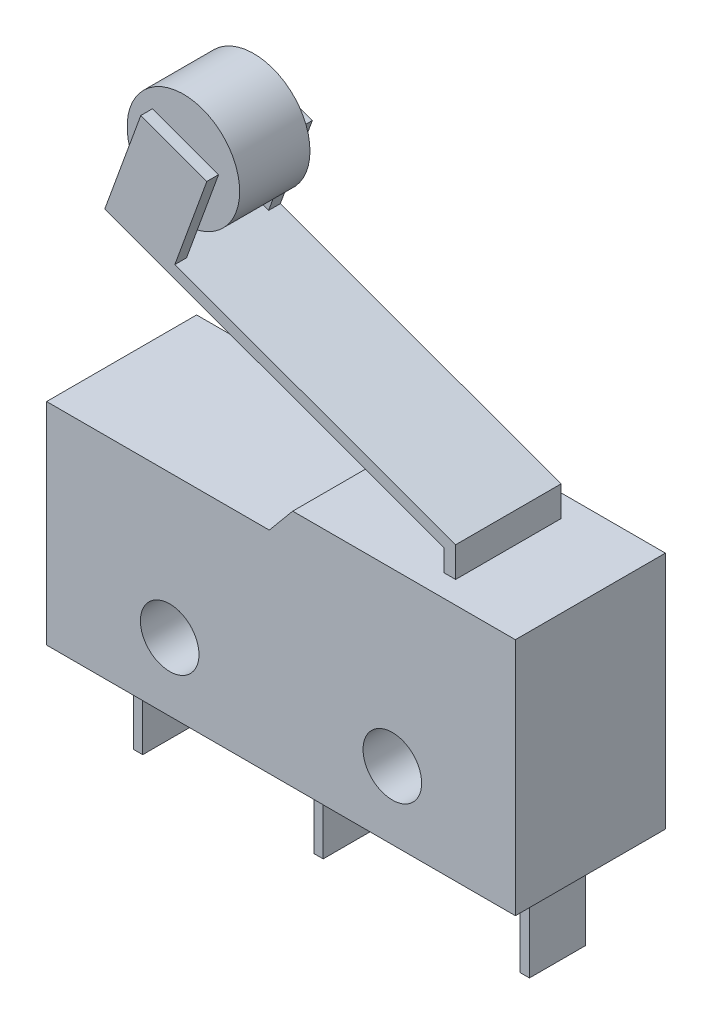
ISO-10303-21;
HEADER;
FILE_DESCRIPTION(('STEP AP214'),'2;1');
FILE_NAME('part.step','',(''),(''),'','','');
FILE_SCHEMA(('AUTOMOTIVE_DESIGN { 1 0 10303 214 1 1 1 1 }'));
ENDSEC;
DATA;
#1=APPLICATION_CONTEXT('core data for automotive mechanical design processes');
#2=APPLICATION_PROTOCOL_DEFINITION('international standard','automotive_design',2000,#1);
#3=PRODUCT_CONTEXT('',#1,'mechanical');
#4=PRODUCT('Part','Part','',(#3));
#5=PRODUCT_RELATED_PRODUCT_CATEGORY('part','',(#4));
#6=PRODUCT_DEFINITION_FORMATION('','',#4);
#7=PRODUCT_DEFINITION_CONTEXT('part definition',#1,'design');
#8=PRODUCT_DEFINITION('design','',#6,#7);
#9=PRODUCT_DEFINITION_SHAPE('','',#8);
#10=(LENGTH_UNIT() NAMED_UNIT(*) SI_UNIT(.MILLI.,.METRE.));
#11=(NAMED_UNIT(*) PLANE_ANGLE_UNIT() SI_UNIT($,.RADIAN.));
#12=(NAMED_UNIT(*) SI_UNIT($,.STERADIAN.) SOLID_ANGLE_UNIT());
#13=UNCERTAINTY_MEASURE_WITH_UNIT(LENGTH_MEASURE(1.E-05),#10,'distance_accuracy_value','');
#14=(GEOMETRIC_REPRESENTATION_CONTEXT(3) GLOBAL_UNCERTAINTY_ASSIGNED_CONTEXT((#13)) GLOBAL_UNIT_ASSIGNED_CONTEXT((#10,
#11,#12)) REPRESENTATION_CONTEXT('',''));
#15=CARTESIAN_POINT('',(0.,0.,0.));
#16=DIRECTION('',(0.,0.,1.));
#17=DIRECTION('',(1.,0.,0.));
#18=AXIS2_PLACEMENT_3D('',#15,#16,#17);
#19=CARTESIAN_POINT('',(4.1360472181271,19.1758939577622,1.5));
#20=DIRECTION('',(0.,0.,-1.));
#21=DIRECTION('',(-1.,0.,0.));
#22=AXIS2_PLACEMENT_3D('',#19,#20,#21);
#23=CYLINDRICAL_SURFACE('',#22,2.4);
#24=CARTESIAN_POINT('',(4.1360472181271,19.1758939577622,1.5));
#25=DIRECTION('',(0.,0.,1.));
#26=DIRECTION('',(1.,0.,0.));
#27=AXIS2_PLACEMENT_3D('',#24,#25,#26);
#28=CIRCLE('',#27,2.4);
#29=CARTESIAN_POINT('',(6.5360472181271,19.1758939577622,1.5));
#30=VERTEX_POINT('',#29);
#31=EDGE_CURVE('E11',#30,#30,#28,.T.);
#32=ORIENTED_EDGE('',*,*,#31,.F.);
#33=EDGE_LOOP('',(#32));
#34=FACE_BOUND('',#33,.T.);
#35=CARTESIAN_POINT('',(4.1360472181271,19.1758939577622,-1.5));
#36=DIRECTION('',(0.,0.,1.));
#37=DIRECTION('',(1.,0.,0.));
#38=AXIS2_PLACEMENT_3D('',#35,#36,#37);
#39=CIRCLE('',#38,2.4);
#40=CARTESIAN_POINT('',(6.5360472181271,19.1758939577622,-1.5));
#41=VERTEX_POINT('',#40);
#42=EDGE_CURVE('E45',#41,#41,#39,.T.);
#43=ORIENTED_EDGE('',*,*,#42,.T.);
#44=EDGE_LOOP('',(#43));
#45=FACE_BOUND('',#44,.T.);
#46=ADVANCED_FACE('F42',(#34,#45),#23,.T.);
#47=CARTESIAN_POINT('',(4.1360472181271,19.1758939577622,1.5));
#48=DIRECTION('',(0.,0.,1.));
#49=DIRECTION('',(1.,0.,0.));
#50=AXIS2_PLACEMENT_3D('',#47,#48,#49);
#51=PLANE('',#50);
#52=ORIENTED_EDGE('',*,*,#31,.T.);
#53=EDGE_LOOP('',(#52));
#54=FACE_BOUND('',#53,.T.);
#55=ADVANCED_FACE('F57',(#54),#51,.T.);
#56=CARTESIAN_POINT('',(4.1360472181271,19.1758939577622,-1.5));
#57=DIRECTION('',(0.,0.,1.));
#58=DIRECTION('',(1.,0.,0.));
#59=AXIS2_PLACEMENT_3D('',#56,#57,#58);
#60=PLANE('',#59);
#61=ORIENTED_EDGE('',*,*,#42,.F.);
#62=EDGE_LOOP('',(#61));
#63=FACE_BOUND('',#62,.T.);
#64=ADVANCED_FACE('F55',(#63),#60,.F.);
#65=CLOSED_SHELL('',(#46,#55,#64));
#66=MANIFOLD_SOLID_BREP('B2',#65);
#67=CARTESIAN_POINT('',(16.5,11.48324984986,2.25));
#68=DIRECTION('',(-0.342020143325663,-0.939692620785911,0.));
#69=DIRECTION('',(0.939692620785911,-0.342020143325663,0.));
#70=AXIS2_PLACEMENT_3D('',#67,#68,#69);
#71=PLANE('',#70);
#72=DIRECTION('',(0.,0.,-1.));
#73=VECTOR('',#72,1.);
#74=CARTESIAN_POINT('',(4.51952571932898,15.843785880416,2.25));
#75=LINE('',#74,#73);
#76=CARTESIAN_POINT('',(4.51952571932898,15.843785880416,2.25));
#77=VERTEX_POINT('',#76);
#78=CARTESIAN_POINT('',(4.51952571932898,15.843785880416,1.75));
#79=VERTEX_POINT('',#78);
#80=EDGE_CURVE('E308',#77,#79,#75,.T.);
#81=ORIENTED_EDGE('',*,*,#80,.F.);
#82=DIRECTION('',(-0.939692620785911,0.342020143325663,0.));
#83=VECTOR('',#82,1.);
#84=CARTESIAN_POINT('',(16.5,11.48324984986,2.25));
#85=LINE('',#84,#83);
#86=CARTESIAN_POINT('',(16.5,11.48324984986,2.25));
#87=VERTEX_POINT('',#86);
#88=EDGE_CURVE('E290',#87,#77,#85,.T.);
#89=ORIENTED_EDGE('',*,*,#88,.F.);
#90=DIRECTION('',(0.,0.,-1.));
#91=VECTOR('',#90,1.);
#92=CARTESIAN_POINT('',(16.5,11.48324984986,2.25));
#93=LINE('',#92,#91);
#94=CARTESIAN_POINT('',(16.5,11.48324984986,-2.25));
#95=VERTEX_POINT('',#94);
#96=EDGE_CURVE('E371',#87,#95,#93,.T.);
#97=ORIENTED_EDGE('',*,*,#96,.T.);
#98=DIRECTION('',(-0.939692620785911,0.342020143325663,0.));
#99=VECTOR('',#98,1.);
#100=CARTESIAN_POINT('',(16.5,11.48324984986,-2.25));
#101=LINE('',#100,#99);
#102=CARTESIAN_POINT('',(4.51952571932897,15.843785880416,-2.25));
#103=VERTEX_POINT('',#102);
#104=EDGE_CURVE('E357',#95,#103,#101,.T.);
#105=ORIENTED_EDGE('',*,*,#104,.T.);
#106=DIRECTION('',(0.,0.,-1.));
#107=VECTOR('',#106,1.);
#108=CARTESIAN_POINT('',(4.51952571932898,15.843785880416,-2.25));
#109=LINE('',#108,#107);
#110=CARTESIAN_POINT('',(4.51952571932898,15.843785880416,-1.75));
#111=VERTEX_POINT('',#110);
#112=EDGE_CURVE('E97',#111,#103,#109,.T.);
#113=ORIENTED_EDGE('',*,*,#112,.F.);
#114=DIRECTION('',(0.93969262078591,-0.342020143325663,0.));
#115=VECTOR('',#114,1.);
#116=CARTESIAN_POINT('',(1.70044785697125,16.869846310393,-1.75));
#117=LINE('',#116,#115);
#118=CARTESIAN_POINT('',(1.70044785697125,16.869846310393,-1.75));
#119=VERTEX_POINT('',#118);
#120=EDGE_CURVE('E320',#119,#111,#117,.T.);
#121=ORIENTED_EDGE('',*,*,#120,.F.);
#122=DIRECTION('',(0.,0.,-1.));
#123=VECTOR('',#122,1.);
#124=CARTESIAN_POINT('',(1.70044785697125,16.869846310393,2.25));
#125=LINE('',#124,#123);
#126=CARTESIAN_POINT('',(1.70044785697125,16.869846310393,1.75));
#127=VERTEX_POINT('',#126);
#128=EDGE_CURVE('E105',#127,#119,#125,.T.);
#129=ORIENTED_EDGE('',*,*,#128,.F.);
#130=DIRECTION('',(-0.93969262078591,0.342020143325663,0.));
#131=VECTOR('',#130,1.);
#132=CARTESIAN_POINT('',(1.70044785697125,16.869846310393,1.75));
#133=LINE('',#132,#131);
#134=EDGE_CURVE('E306',#79,#127,#133,.T.);
#135=ORIENTED_EDGE('',*,*,#134,.F.);
#136=EDGE_LOOP('',(#81,#89,#97,#105,#113,#121,#129,#135));
#137=FACE_BOUND('',#136,.T.);
#138=ADVANCED_FACE('F82',(#137),#71,.F.);
#139=CARTESIAN_POINT('',(10.5,10.2,3.2));
#140=DIRECTION('',(0.,-1.,0.));
#141=DIRECTION('',(0.,0.,-1.));
#142=AXIS2_PLACEMENT_3D('',#139,#140,#141);
#143=PLANE('',#142);
#144=DIRECTION('',(-1.,0.,0.));
#145=VECTOR('',#144,1.);
#146=CARTESIAN_POINT('',(10.5,10.2,-3.2));
#147=LINE('',#146,#145);
#148=CARTESIAN_POINT('',(20.,10.2,-3.2));
#149=VERTEX_POINT('',#148);
#150=CARTESIAN_POINT('',(10.5,10.2,-3.2));
#151=VERTEX_POINT('',#150);
#152=EDGE_CURVE('E509',#149,#151,#147,.T.);
#153=ORIENTED_EDGE('',*,*,#152,.T.);
#154=DIRECTION('',(0.,0.,-1.));
#155=VECTOR('',#154,1.);
#156=CARTESIAN_POINT('',(10.5,10.2,3.2));
#157=LINE('',#156,#155);
#158=CARTESIAN_POINT('',(10.5,10.2,3.2));
#159=VERTEX_POINT('',#158);
#160=EDGE_CURVE('E519',#159,#151,#157,.T.);
#161=ORIENTED_EDGE('',*,*,#160,.F.);
#162=DIRECTION('',(-1.,0.,0.));
#163=VECTOR('',#162,1.);
#164=CARTESIAN_POINT('',(10.5,10.2,3.2));
#165=LINE('',#164,#163);
#166=CARTESIAN_POINT('',(20.,10.2,3.2));
#167=VERTEX_POINT('',#166);
#168=EDGE_CURVE('E496',#167,#159,#165,.T.);
#169=ORIENTED_EDGE('',*,*,#168,.F.);
#170=DIRECTION('',(0.,0.,-1.));
#171=VECTOR('',#170,1.);
#172=CARTESIAN_POINT('',(20.,10.2,3.2));
#173=LINE('',#172,#171);
#174=EDGE_CURVE('E522',#167,#149,#173,.T.);
#175=ORIENTED_EDGE('',*,*,#174,.T.);
#176=EDGE_LOOP('',(#153,#161,#169,#175));
#177=FACE_BOUND('',#176,.T.);
#178=DIRECTION('',(1.,0.,0.));
#179=VECTOR('',#178,1.);
#180=CARTESIAN_POINT('',(16.5,10.2,2.25));
#181=LINE('',#180,#179);
#182=CARTESIAN_POINT('',(16.,10.2,2.25));
#183=VERTEX_POINT('',#182);
#184=CARTESIAN_POINT('',(16.5,10.2,2.25));
#185=VERTEX_POINT('',#184);
#186=EDGE_CURVE('E343',#183,#185,#181,.T.);
#187=ORIENTED_EDGE('',*,*,#186,.F.);
#188=DIRECTION('',(0.,0.,-1.));
#189=VECTOR('',#188,1.);
#190=CARTESIAN_POINT('',(16.,10.2,2.25));
#191=LINE('',#190,#189);
#192=CARTESIAN_POINT('',(16.,10.2,-2.25));
#193=VERTEX_POINT('',#192);
#194=EDGE_CURVE('E352',#183,#193,#191,.T.);
#195=ORIENTED_EDGE('',*,*,#194,.T.);
#196=DIRECTION('',(1.,0.,0.));
#197=VECTOR('',#196,1.);
#198=CARTESIAN_POINT('',(16.5,10.2,-2.25));
#199=LINE('',#198,#197);
#200=CARTESIAN_POINT('',(16.5,10.2,-2.25));
#201=VERTEX_POINT('',#200);
#202=EDGE_CURVE('E342',#193,#201,#199,.T.);
#203=ORIENTED_EDGE('',*,*,#202,.T.);
#204=DIRECTION('',(0.,0.,-1.));
#205=VECTOR('',#204,1.);
#206=CARTESIAN_POINT('',(16.5,10.2,2.25));
#207=LINE('',#206,#205);
#208=EDGE_CURVE('E374',#185,#201,#207,.T.);
#209=ORIENTED_EDGE('',*,*,#208,.F.);
#210=EDGE_LOOP('',(#187,#195,#203,#209));
#211=FACE_BOUND('',#210,.T.);
#212=ADVANCED_FACE('F541',(#177,#211),#143,.F.);
#213=CARTESIAN_POINT('',(0.,0.,3.2));
#214=DIRECTION('',(0.,1.,0.));
#215=DIRECTION('',(0.,0.,1.));
#216=AXIS2_PLACEMENT_3D('',#213,#214,#215);
#217=PLANE('',#216);
#218=DIRECTION('',(0.,0.,-1.));
#219=VECTOR('',#218,1.);
#220=CARTESIAN_POINT('',(9.4,0.,1.2));
#221=LINE('',#220,#219);
#222=CARTESIAN_POINT('',(9.4,0.,1.2));
#223=VERTEX_POINT('',#222);
#224=CARTESIAN_POINT('',(9.4,0.,-1.2));
#225=VERTEX_POINT('',#224);
#226=EDGE_CURVE('E409',#223,#225,#221,.T.);
#227=ORIENTED_EDGE('',*,*,#226,.F.);
#228=DIRECTION('',(-1.,0.,0.));
#229=VECTOR('',#228,1.);
#230=CARTESIAN_POINT('',(9.4,0.,1.2));
#231=LINE('',#230,#229);
#232=CARTESIAN_POINT('',(9.8,0.,1.2));
#233=VERTEX_POINT('',#232);
#234=EDGE_CURVE('E414',#233,#223,#231,.T.);
#235=ORIENTED_EDGE('',*,*,#234,.F.);
#236=DIRECTION('',(0.,0.,1.));
#237=VECTOR('',#236,1.);
#238=CARTESIAN_POINT('',(9.8,0.,1.2));
#239=LINE('',#238,#237);
#240=CARTESIAN_POINT('',(9.8,0.,-1.2));
#241=VERTEX_POINT('',#240);
#242=EDGE_CURVE('E426',#241,#233,#239,.T.);
#243=ORIENTED_EDGE('',*,*,#242,.F.);
#244=DIRECTION('',(1.,0.,0.));
#245=VECTOR('',#244,1.);
#246=CARTESIAN_POINT('',(9.4,0.,-1.2));
#247=LINE('',#246,#245);
#248=EDGE_CURVE('E423',#225,#241,#247,.T.);
#249=ORIENTED_EDGE('',*,*,#248,.F.);
#250=EDGE_LOOP('',(#227,#235,#243,#249));
#251=FACE_BOUND('',#250,.T.);
#252=DIRECTION('',(1.,0.,0.));
#253=VECTOR('',#252,1.);
#254=CARTESIAN_POINT('',(0.,0.,-3.2));
#255=LINE('',#254,#253);
#256=CARTESIAN_POINT('',(0.,0.,-3.2));
#257=VERTEX_POINT('',#256);
#258=CARTESIAN_POINT('',(20.,0.,-3.2));
#259=VERTEX_POINT('',#258);
#260=EDGE_CURVE('E505',#257,#259,#255,.T.);
#261=ORIENTED_EDGE('',*,*,#260,.T.);
#262=DIRECTION('',(0.,0.,-1.));
#263=VECTOR('',#262,1.);
#264=CARTESIAN_POINT('',(20.,0.,3.2));
#265=LINE('',#264,#263);
#266=CARTESIAN_POINT('',(20.,0.,3.2));
#267=VERTEX_POINT('',#266);
#268=EDGE_CURVE('E90',#267,#259,#265,.T.);
#269=ORIENTED_EDGE('',*,*,#268,.F.);
#270=DIRECTION('',(1.,0.,0.));
#271=VECTOR('',#270,1.);
#272=CARTESIAN_POINT('',(0.,0.,3.2));
#273=LINE('',#272,#271);
#274=CARTESIAN_POINT('',(0.,0.,3.2));
#275=VERTEX_POINT('',#274);
#276=EDGE_CURVE('E491',#275,#267,#273,.T.);
#277=ORIENTED_EDGE('',*,*,#276,.F.);
#278=DIRECTION('',(0.,0.,-1.));
#279=VECTOR('',#278,1.);
#280=CARTESIAN_POINT('',(0.,0.,3.2));
#281=LINE('',#280,#279);
#282=EDGE_CURVE('E40',#275,#257,#281,.T.);
#283=ORIENTED_EDGE('',*,*,#282,.T.);
#284=EDGE_LOOP('',(#261,#269,#277,#283));
#285=FACE_BOUND('',#284,.T.);
#286=DIRECTION('',(0.,0.,-1.));
#287=VECTOR('',#286,1.);
#288=CARTESIAN_POINT('',(1.7,0.,1.2));
#289=LINE('',#288,#287);
#290=CARTESIAN_POINT('',(1.7,0.,1.2));
#291=VERTEX_POINT('',#290);
#292=CARTESIAN_POINT('',(1.7,0.,-1.2));
#293=VERTEX_POINT('',#292);
#294=EDGE_CURVE('E442',#291,#293,#289,.T.);
#295=ORIENTED_EDGE('',*,*,#294,.F.);
#296=DIRECTION('',(-1.,0.,0.));
#297=VECTOR('',#296,1.);
#298=CARTESIAN_POINT('',(1.7,0.,1.2));
#299=LINE('',#298,#297);
#300=CARTESIAN_POINT('',(2.1,0.,1.2));
#301=VERTEX_POINT('',#300);
#302=EDGE_CURVE('E447',#301,#291,#299,.T.);
#303=ORIENTED_EDGE('',*,*,#302,.F.);
#304=DIRECTION('',(0.,0.,1.));
#305=VECTOR('',#304,1.);
#306=CARTESIAN_POINT('',(2.1,0.,1.2));
#307=LINE('',#306,#305);
#308=CARTESIAN_POINT('',(2.1,0.,-1.2));
#309=VERTEX_POINT('',#308);
#310=EDGE_CURVE('E459',#309,#301,#307,.T.);
#311=ORIENTED_EDGE('',*,*,#310,.F.);
#312=DIRECTION('',(1.,0.,0.));
#313=VECTOR('',#312,1.);
#314=CARTESIAN_POINT('',(1.7,0.,-1.2));
#315=LINE('',#314,#313);
#316=EDGE_CURVE('E456',#293,#309,#315,.T.);
#317=ORIENTED_EDGE('',*,*,#316,.F.);
#318=EDGE_LOOP('',(#295,#303,#311,#317));
#319=FACE_BOUND('',#318,.T.);
#320=DIRECTION('',(0.,0.,-1.));
#321=VECTOR('',#320,1.);
#322=CARTESIAN_POINT('',(18.2,0.,1.2));
#323=LINE('',#322,#321);
#324=CARTESIAN_POINT('',(18.2,0.,1.2));
#325=VERTEX_POINT('',#324);
#326=CARTESIAN_POINT('',(18.2,0.,-1.2));
#327=VERTEX_POINT('',#326);
#328=EDGE_CURVE('E376',#325,#327,#323,.T.);
#329=ORIENTED_EDGE('',*,*,#328,.F.);
#330=DIRECTION('',(-1.,0.,0.));
#331=VECTOR('',#330,1.);
#332=CARTESIAN_POINT('',(18.2,0.,1.2));
#333=LINE('',#332,#331);
#334=CARTESIAN_POINT('',(18.6,0.,1.2));
#335=VERTEX_POINT('',#334);
#336=EDGE_CURVE('E381',#335,#325,#333,.T.);
#337=ORIENTED_EDGE('',*,*,#336,.F.);
#338=DIRECTION('',(0.,0.,1.));
#339=VECTOR('',#338,1.);
#340=CARTESIAN_POINT('',(18.6,0.,1.2));
#341=LINE('',#340,#339);
#342=CARTESIAN_POINT('',(18.6,0.,-1.2));
#343=VERTEX_POINT('',#342);
#344=EDGE_CURVE('E393',#343,#335,#341,.T.);
#345=ORIENTED_EDGE('',*,*,#344,.F.);
#346=DIRECTION('',(1.,0.,0.));
#347=VECTOR('',#346,1.);
#348=CARTESIAN_POINT('',(18.2,0.,-1.2));
#349=LINE('',#348,#347);
#350=EDGE_CURVE('E390',#327,#343,#349,.T.);
#351=ORIENTED_EDGE('',*,*,#350,.F.);
#352=EDGE_LOOP('',(#329,#337,#345,#351));
#353=FACE_BOUND('',#352,.T.);
#354=ADVANCED_FACE('F555',(#251,#285,#319,#353),#217,.F.);
#355=CARTESIAN_POINT('',(0.,0.,3.2));
#356=DIRECTION('',(0.,0.,-1.));
#357=DIRECTION('',(-1.,0.,0.));
#358=AXIS2_PLACEMENT_3D('',#355,#356,#357);
#359=PLANE('',#358);
#360=CARTESIAN_POINT('',(5.25,2.9,3.2));
#361=DIRECTION('',(0.,0.,1.));
#362=DIRECTION('',(1.,0.,0.));
#363=AXIS2_PLACEMENT_3D('',#360,#361,#362);
#364=CIRCLE('',#363,1.25);
#365=CARTESIAN_POINT('',(6.5,2.9,3.2));
#366=VERTEX_POINT('',#365);
#367=EDGE_CURVE('E482',#366,#366,#364,.T.);
#368=ORIENTED_EDGE('',*,*,#367,.F.);
#369=EDGE_LOOP('',(#368));
#370=FACE_BOUND('',#369,.T.);
#371=DIRECTION('',(0.,-1.,0.));
#372=VECTOR('',#371,1.);
#373=CARTESIAN_POINT('',(0.,0.,3.2));
#374=LINE('',#373,#372);
#375=CARTESIAN_POINT('',(0.,9.,3.2));
#376=VERTEX_POINT('',#375);
#377=EDGE_CURVE('E488',#376,#275,#374,.T.);
#378=ORIENTED_EDGE('',*,*,#377,.T.);
#379=ORIENTED_EDGE('',*,*,#276,.T.);
#380=DIRECTION('',(0.,1.,0.));
#381=VECTOR('',#380,1.);
#382=CARTESIAN_POINT('',(20.,0.,3.2));
#383=LINE('',#382,#381);
#384=EDGE_CURVE('E494',#267,#167,#383,.T.);
#385=ORIENTED_EDGE('',*,*,#384,.T.);
#386=ORIENTED_EDGE('',*,*,#168,.T.);
#387=DIRECTION('',(-0.64018439966448,-0.768221279597375,0.));
#388=VECTOR('',#387,1.);
#389=CARTESIAN_POINT('',(9.5,9.,3.2));
#390=LINE('',#389,#388);
#391=CARTESIAN_POINT('',(9.5,9.,3.2));
#392=VERTEX_POINT('',#391);
#393=EDGE_CURVE('E498',#159,#392,#390,.T.);
#394=ORIENTED_EDGE('',*,*,#393,.T.);
#395=DIRECTION('',(-1.,0.,0.));
#396=VECTOR('',#395,1.);
#397=CARTESIAN_POINT('',(0.,9.,3.2));
#398=LINE('',#397,#396);
#399=EDGE_CURVE('E500',#392,#376,#398,.T.);
#400=ORIENTED_EDGE('',*,*,#399,.T.);
#401=EDGE_LOOP('',(#378,#379,#385,#386,#394,#400));
#402=FACE_BOUND('',#401,.T.);
#403=CARTESIAN_POINT('',(14.75,2.9,3.2));
#404=DIRECTION('',(0.,0.,1.));
#405=DIRECTION('',(1.,0.,0.));
#406=AXIS2_PLACEMENT_3D('',#403,#404,#405);
#407=CIRCLE('',#406,1.25);
#408=CARTESIAN_POINT('',(16.,2.9,3.2));
#409=VERTEX_POINT('',#408);
#410=EDGE_CURVE('E476',#409,#409,#407,.T.);
#411=ORIENTED_EDGE('',*,*,#410,.F.);
#412=EDGE_LOOP('',(#411));
#413=FACE_BOUND('',#412,.T.);
#414=ADVANCED_FACE('F550',(#370,#402,#413),#359,.F.);
#415=CARTESIAN_POINT('',(0.,0.,-3.2));
#416=DIRECTION('',(0.,0.,-1.));
#417=DIRECTION('',(-1.,0.,0.));
#418=AXIS2_PLACEMENT_3D('',#415,#416,#417);
#419=PLANE('',#418);
#420=CARTESIAN_POINT('',(5.25,2.9,-3.2));
#421=DIRECTION('',(0.,0.,1.));
#422=DIRECTION('',(1.,0.,0.));
#423=AXIS2_PLACEMENT_3D('',#420,#421,#422);
#424=CIRCLE('',#423,1.25);
#425=CARTESIAN_POINT('',(6.5,2.9,-3.2));
#426=VERTEX_POINT('',#425);
#427=EDGE_CURVE('E479',#426,#426,#424,.T.);
#428=ORIENTED_EDGE('',*,*,#427,.T.);
#429=EDGE_LOOP('',(#428));
#430=FACE_BOUND('',#429,.T.);
#431=DIRECTION('',(0.,-1.,0.));
#432=VECTOR('',#431,1.);
#433=CARTESIAN_POINT('',(0.,0.,-3.2));
#434=LINE('',#433,#432);
#435=CARTESIAN_POINT('',(0.,9.,-3.2));
#436=VERTEX_POINT('',#435);
#437=EDGE_CURVE('E485',#436,#257,#434,.T.);
#438=ORIENTED_EDGE('',*,*,#437,.F.);
#439=DIRECTION('',(-1.,0.,0.));
#440=VECTOR('',#439,1.);
#441=CARTESIAN_POINT('',(0.,9.,-3.2));
#442=LINE('',#441,#440);
#443=CARTESIAN_POINT('',(9.5,9.,-3.2));
#444=VERTEX_POINT('',#443);
#445=EDGE_CURVE('E492',#444,#436,#442,.T.);
#446=ORIENTED_EDGE('',*,*,#445,.F.);
#447=DIRECTION('',(-0.64018439966448,-0.768221279597375,0.));
#448=VECTOR('',#447,1.);
#449=CARTESIAN_POINT('',(9.5,9.,-3.2));
#450=LINE('',#449,#448);
#451=EDGE_CURVE('E511',#151,#444,#450,.T.);
#452=ORIENTED_EDGE('',*,*,#451,.F.);
#453=ORIENTED_EDGE('',*,*,#152,.F.);
#454=DIRECTION('',(0.,1.,0.));
#455=VECTOR('',#454,1.);
#456=CARTESIAN_POINT('',(20.,0.,-3.2));
#457=LINE('',#456,#455);
#458=EDGE_CURVE('E507',#259,#149,#457,.T.);
#459=ORIENTED_EDGE('',*,*,#458,.F.);
#460=ORIENTED_EDGE('',*,*,#260,.F.);
#461=EDGE_LOOP('',(#438,#446,#452,#453,#459,#460));
#462=FACE_BOUND('',#461,.T.);
#463=CARTESIAN_POINT('',(14.75,2.9,-3.2));
#464=DIRECTION('',(0.,0.,1.));
#465=DIRECTION('',(1.,0.,0.));
#466=AXIS2_PLACEMENT_3D('',#463,#464,#465);
#467=CIRCLE('',#466,1.25);
#468=CARTESIAN_POINT('',(16.,2.9,-3.2));
#469=VERTEX_POINT('',#468);
#470=EDGE_CURVE('E475',#469,#469,#467,.T.);
#471=ORIENTED_EDGE('',*,*,#470,.T.);
#472=EDGE_LOOP('',(#471));
#473=FACE_BOUND('',#472,.T.);
#474=ADVANCED_FACE('F535',(#430,#462,#473),#419,.T.);
#475=CARTESIAN_POINT('',(0.,0.,3.2));
#476=DIRECTION('',(1.,0.,0.));
#477=DIRECTION('',(0.,0.,-1.));
#478=AXIS2_PLACEMENT_3D('',#475,#476,#477);
#479=PLANE('',#478);
#480=ORIENTED_EDGE('',*,*,#437,.T.);
#481=ORIENTED_EDGE('',*,*,#282,.F.);
#482=ORIENTED_EDGE('',*,*,#377,.F.);
#483=DIRECTION('',(0.,0.,-1.));
#484=VECTOR('',#483,1.);
#485=CARTESIAN_POINT('',(0.,9.,3.2));
#486=LINE('',#485,#484);
#487=EDGE_CURVE('E502',#376,#436,#486,.T.);
#488=ORIENTED_EDGE('',*,*,#487,.T.);
#489=EDGE_LOOP('',(#480,#481,#482,#488));
#490=FACE_BOUND('',#489,.T.);
#491=ADVANCED_FACE('F84',(#490),#479,.F.);
#492=CARTESIAN_POINT('',(20.,0.,3.2));
#493=DIRECTION('',(-1.,0.,0.));
#494=DIRECTION('',(0.,0.,1.));
#495=AXIS2_PLACEMENT_3D('',#492,#493,#494);
#496=PLANE('',#495);
#497=ORIENTED_EDGE('',*,*,#458,.T.);
#498=ORIENTED_EDGE('',*,*,#174,.F.);
#499=ORIENTED_EDGE('',*,*,#384,.F.);
#500=ORIENTED_EDGE('',*,*,#268,.T.);
#501=EDGE_LOOP('',(#497,#498,#499,#500));
#502=FACE_BOUND('',#501,.T.);
#503=ADVANCED_FACE('F529',(#502),#496,.F.);
#504=CARTESIAN_POINT('',(9.5,9.,3.2));
#505=DIRECTION('',(0.768221279597376,-0.64018439966448,0.));
#506=DIRECTION('',(0.64018439966448,0.768221279597376,0.));
#507=AXIS2_PLACEMENT_3D('',#504,#505,#506);
#508=PLANE('',#507);
#509=ORIENTED_EDGE('',*,*,#451,.T.);
#510=DIRECTION('',(0.,0.,-1.));
#511=VECTOR('',#510,1.);
#512=CARTESIAN_POINT('',(9.5,9.,3.2));
#513=LINE('',#512,#511);
#514=EDGE_CURVE('E516',#392,#444,#513,.T.);
#515=ORIENTED_EDGE('',*,*,#514,.F.);
#516=ORIENTED_EDGE('',*,*,#393,.F.);
#517=ORIENTED_EDGE('',*,*,#160,.T.);
#518=EDGE_LOOP('',(#509,#515,#516,#517));
#519=FACE_BOUND('',#518,.T.);
#520=ADVANCED_FACE('F546',(#519),#508,.F.);
#521=CARTESIAN_POINT('',(0.,9.,3.2));
#522=DIRECTION('',(0.,-1.,0.));
#523=DIRECTION('',(0.,0.,-1.));
#524=AXIS2_PLACEMENT_3D('',#521,#522,#523);
#525=PLANE('',#524);
#526=ORIENTED_EDGE('',*,*,#445,.T.);
#527=ORIENTED_EDGE('',*,*,#487,.F.);
#528=ORIENTED_EDGE('',*,*,#399,.F.);
#529=ORIENTED_EDGE('',*,*,#514,.T.);
#530=EDGE_LOOP('',(#526,#527,#528,#529));
#531=FACE_BOUND('',#530,.T.);
#532=ADVANCED_FACE('F559',(#531),#525,.F.);
#533=CARTESIAN_POINT('',(5.25,2.9,3.2));
#534=DIRECTION('',(0.,0.,-1.));
#535=DIRECTION('',(-1.,0.,0.));
#536=AXIS2_PLACEMENT_3D('',#533,#534,#535);
#537=CYLINDRICAL_SURFACE('',#536,1.25);
#538=ORIENTED_EDGE('',*,*,#367,.T.);
#539=EDGE_LOOP('',(#538));
#540=FACE_BOUND('',#539,.T.);
#541=ORIENTED_EDGE('',*,*,#427,.F.);
#542=EDGE_LOOP('',(#541));
#543=FACE_BOUND('',#542,.T.);
#544=ADVANCED_FACE('F561',(#540,#543),#537,.F.);
#545=CARTESIAN_POINT('',(14.75,2.9,3.2));
#546=DIRECTION('',(0.,0.,-1.));
#547=DIRECTION('',(-1.,0.,0.));
#548=AXIS2_PLACEMENT_3D('',#545,#546,#547);
#549=CYLINDRICAL_SURFACE('',#548,1.25);
#550=ORIENTED_EDGE('',*,*,#410,.T.);
#551=EDGE_LOOP('',(#550));
#552=FACE_BOUND('',#551,.T.);
#553=ORIENTED_EDGE('',*,*,#470,.F.);
#554=EDGE_LOOP('',(#553));
#555=FACE_BOUND('',#554,.T.);
#556=ADVANCED_FACE('F567',(#552,#555),#549,.F.);
#557=CARTESIAN_POINT('',(1.7,-4.,1.2));
#558=DIRECTION('',(1.,0.,0.));
#559=DIRECTION('',(0.,0.,-1.));
#560=AXIS2_PLACEMENT_3D('',#557,#558,#559);
#561=PLANE('',#560);
#562=ORIENTED_EDGE('',*,*,#294,.T.);
#563=DIRECTION('',(0.,1.,0.));
#564=VECTOR('',#563,1.);
#565=CARTESIAN_POINT('',(1.7,-4.,-1.2));
#566=LINE('',#565,#564);
#567=CARTESIAN_POINT('',(1.7,-4.,-1.2));
#568=VERTEX_POINT('',#567);
#569=EDGE_CURVE('E472',#568,#293,#566,.T.);
#570=ORIENTED_EDGE('',*,*,#569,.F.);
#571=DIRECTION('',(0.,0.,-1.));
#572=VECTOR('',#571,1.);
#573=CARTESIAN_POINT('',(1.7,-4.,1.2));
#574=LINE('',#573,#572);
#575=CARTESIAN_POINT('',(1.7,-4.,1.2));
#576=VERTEX_POINT('',#575);
#577=EDGE_CURVE('E443',#576,#568,#574,.T.);
#578=ORIENTED_EDGE('',*,*,#577,.F.);
#579=DIRECTION('',(0.,1.,0.));
#580=VECTOR('',#579,1.);
#581=CARTESIAN_POINT('',(1.7,-4.,1.2));
#582=LINE('',#581,#580);
#583=EDGE_CURVE('E453',#576,#291,#582,.T.);
#584=ORIENTED_EDGE('',*,*,#583,.T.);
#585=EDGE_LOOP('',(#562,#570,#578,#584));
#586=FACE_BOUND('',#585,.T.);
#587=ADVANCED_FACE('F641',(#586),#561,.F.);
#588=CARTESIAN_POINT('',(1.7,-4.,-1.2));
#589=DIRECTION('',(0.,0.,1.));
#590=DIRECTION('',(1.,0.,0.));
#591=AXIS2_PLACEMENT_3D('',#588,#589,#590);
#592=PLANE('',#591);
#593=ORIENTED_EDGE('',*,*,#316,.T.);
#594=DIRECTION('',(0.,1.,0.));
#595=VECTOR('',#594,1.);
#596=CARTESIAN_POINT('',(2.1,-4.,-1.2));
#597=LINE('',#596,#595);
#598=CARTESIAN_POINT('',(2.1,-4.,-1.2));
#599=VERTEX_POINT('',#598);
#600=EDGE_CURVE('E469',#599,#309,#597,.T.);
#601=ORIENTED_EDGE('',*,*,#600,.F.);
#602=DIRECTION('',(1.,0.,0.));
#603=VECTOR('',#602,1.);
#604=CARTESIAN_POINT('',(1.7,-4.,-1.2));
#605=LINE('',#604,#603);
#606=EDGE_CURVE('E446',#568,#599,#605,.T.);
#607=ORIENTED_EDGE('',*,*,#606,.F.);
#608=ORIENTED_EDGE('',*,*,#569,.T.);
#609=EDGE_LOOP('',(#593,#601,#607,#608));
#610=FACE_BOUND('',#609,.T.);
#611=ADVANCED_FACE('F637',(#610),#592,.F.);
#612=CARTESIAN_POINT('',(2.1,-4.,1.2));
#613=DIRECTION('',(-1.,0.,0.));
#614=DIRECTION('',(0.,0.,1.));
#615=AXIS2_PLACEMENT_3D('',#612,#613,#614);
#616=PLANE('',#615);
#617=ORIENTED_EDGE('',*,*,#310,.T.);
#618=DIRECTION('',(0.,1.,0.));
#619=VECTOR('',#618,1.);
#620=CARTESIAN_POINT('',(2.1,-4.,1.2));
#621=LINE('',#620,#619);
#622=CARTESIAN_POINT('',(2.1,-4.,1.2));
#623=VERTEX_POINT('',#622);
#624=EDGE_CURVE('E466',#623,#301,#621,.T.);
#625=ORIENTED_EDGE('',*,*,#624,.F.);
#626=DIRECTION('',(0.,0.,1.));
#627=VECTOR('',#626,1.);
#628=CARTESIAN_POINT('',(2.1,-4.,1.2));
#629=LINE('',#628,#627);
#630=EDGE_CURVE('E449',#599,#623,#629,.T.);
#631=ORIENTED_EDGE('',*,*,#630,.F.);
#632=ORIENTED_EDGE('',*,*,#600,.T.);
#633=EDGE_LOOP('',(#617,#625,#631,#632));
#634=FACE_BOUND('',#633,.T.);
#635=ADVANCED_FACE('F633',(#634),#616,.F.);
#636=CARTESIAN_POINT('',(1.7,-4.,1.2));
#637=DIRECTION('',(0.,0.,-1.));
#638=DIRECTION('',(-1.,0.,0.));
#639=AXIS2_PLACEMENT_3D('',#636,#637,#638);
#640=PLANE('',#639);
#641=ORIENTED_EDGE('',*,*,#302,.T.);
#642=ORIENTED_EDGE('',*,*,#583,.F.);
#643=DIRECTION('',(-1.,0.,0.));
#644=VECTOR('',#643,1.);
#645=CARTESIAN_POINT('',(1.7,-4.,1.2));
#646=LINE('',#645,#644);
#647=EDGE_CURVE('E451',#623,#576,#646,.T.);
#648=ORIENTED_EDGE('',*,*,#647,.F.);
#649=ORIENTED_EDGE('',*,*,#624,.T.);
#650=EDGE_LOOP('',(#641,#642,#648,#649));
#651=FACE_BOUND('',#650,.T.);
#652=ADVANCED_FACE('F629',(#651),#640,.F.);
#653=CARTESIAN_POINT('',(0.,-4.,0.));
#654=DIRECTION('',(0.,-1.,0.));
#655=DIRECTION('',(0.,0.,-1.));
#656=AXIS2_PLACEMENT_3D('',#653,#654,#655);
#657=PLANE('',#656);
#658=ORIENTED_EDGE('',*,*,#577,.T.);
#659=ORIENTED_EDGE('',*,*,#606,.T.);
#660=ORIENTED_EDGE('',*,*,#630,.T.);
#661=ORIENTED_EDGE('',*,*,#647,.T.);
#662=EDGE_LOOP('',(#658,#659,#660,#661));
#663=FACE_BOUND('',#662,.T.);
#664=ADVANCED_FACE('F625',(#663),#657,.T.);
#665=CARTESIAN_POINT('',(9.4,-4.,1.2));
#666=DIRECTION('',(1.,0.,0.));
#667=DIRECTION('',(0.,0.,-1.));
#668=AXIS2_PLACEMENT_3D('',#665,#666,#667);
#669=PLANE('',#668);
#670=ORIENTED_EDGE('',*,*,#226,.T.);
#671=DIRECTION('',(0.,1.,0.));
#672=VECTOR('',#671,1.);
#673=CARTESIAN_POINT('',(9.4,-4.,-1.2));
#674=LINE('',#673,#672);
#675=CARTESIAN_POINT('',(9.4,-4.,-1.2));
#676=VERTEX_POINT('',#675);
#677=EDGE_CURVE('E439',#676,#225,#674,.T.);
#678=ORIENTED_EDGE('',*,*,#677,.F.);
#679=DIRECTION('',(0.,0.,-1.));
#680=VECTOR('',#679,1.);
#681=CARTESIAN_POINT('',(9.4,-4.,1.2));
#682=LINE('',#681,#680);
#683=CARTESIAN_POINT('',(9.4,-4.,1.2));
#684=VERTEX_POINT('',#683);
#685=EDGE_CURVE('E410',#684,#676,#682,.T.);
#686=ORIENTED_EDGE('',*,*,#685,.F.);
#687=DIRECTION('',(0.,1.,0.));
#688=VECTOR('',#687,1.);
#689=CARTESIAN_POINT('',(9.4,-4.,1.2));
#690=LINE('',#689,#688);
#691=EDGE_CURVE('E420',#684,#223,#690,.T.);
#692=ORIENTED_EDGE('',*,*,#691,.T.);
#693=EDGE_LOOP('',(#670,#678,#686,#692));
#694=FACE_BOUND('',#693,.T.);
#695=ADVANCED_FACE('F621',(#694),#669,.F.);
#696=CARTESIAN_POINT('',(9.4,-4.,-1.2));
#697=DIRECTION('',(0.,0.,1.));
#698=DIRECTION('',(1.,0.,0.));
#699=AXIS2_PLACEMENT_3D('',#696,#697,#698);
#700=PLANE('',#699);
#701=ORIENTED_EDGE('',*,*,#248,.T.);
#702=DIRECTION('',(0.,1.,0.));
#703=VECTOR('',#702,1.);
#704=CARTESIAN_POINT('',(9.8,-4.,-1.2));
#705=LINE('',#704,#703);
#706=CARTESIAN_POINT('',(9.8,-4.,-1.2));
#707=VERTEX_POINT('',#706);
#708=EDGE_CURVE('E436',#707,#241,#705,.T.);
#709=ORIENTED_EDGE('',*,*,#708,.F.);
#710=DIRECTION('',(1.,0.,0.));
#711=VECTOR('',#710,1.);
#712=CARTESIAN_POINT('',(9.4,-4.,-1.2));
#713=LINE('',#712,#711);
#714=EDGE_CURVE('E413',#676,#707,#713,.T.);
#715=ORIENTED_EDGE('',*,*,#714,.F.);
#716=ORIENTED_EDGE('',*,*,#677,.T.);
#717=EDGE_LOOP('',(#701,#709,#715,#716));
#718=FACE_BOUND('',#717,.T.);
#719=ADVANCED_FACE('F617',(#718),#700,.F.);
#720=CARTESIAN_POINT('',(9.8,-4.,1.2));
#721=DIRECTION('',(-1.,0.,0.));
#722=DIRECTION('',(0.,0.,1.));
#723=AXIS2_PLACEMENT_3D('',#720,#721,#722);
#724=PLANE('',#723);
#725=ORIENTED_EDGE('',*,*,#242,.T.);
#726=DIRECTION('',(0.,1.,0.));
#727=VECTOR('',#726,1.);
#728=CARTESIAN_POINT('',(9.8,-4.,1.2));
#729=LINE('',#728,#727);
#730=CARTESIAN_POINT('',(9.8,-4.,1.2));
#731=VERTEX_POINT('',#730);
#732=EDGE_CURVE('E433',#731,#233,#729,.T.);
#733=ORIENTED_EDGE('',*,*,#732,.F.);
#734=DIRECTION('',(0.,0.,1.));
#735=VECTOR('',#734,1.);
#736=CARTESIAN_POINT('',(9.8,-4.,1.2));
#737=LINE('',#736,#735);
#738=EDGE_CURVE('E416',#707,#731,#737,.T.);
#739=ORIENTED_EDGE('',*,*,#738,.F.);
#740=ORIENTED_EDGE('',*,*,#708,.T.);
#741=EDGE_LOOP('',(#725,#733,#739,#740));
#742=FACE_BOUND('',#741,.T.);
#743=ADVANCED_FACE('F613',(#742),#724,.F.);
#744=CARTESIAN_POINT('',(9.4,-4.,1.2));
#745=DIRECTION('',(0.,0.,-1.));
#746=DIRECTION('',(-1.,0.,0.));
#747=AXIS2_PLACEMENT_3D('',#744,#745,#746);
#748=PLANE('',#747);
#749=ORIENTED_EDGE('',*,*,#234,.T.);
#750=ORIENTED_EDGE('',*,*,#691,.F.);
#751=DIRECTION('',(-1.,0.,0.));
#752=VECTOR('',#751,1.);
#753=CARTESIAN_POINT('',(9.4,-4.,1.2));
#754=LINE('',#753,#752);
#755=EDGE_CURVE('E418',#731,#684,#754,.T.);
#756=ORIENTED_EDGE('',*,*,#755,.F.);
#757=ORIENTED_EDGE('',*,*,#732,.T.);
#758=EDGE_LOOP('',(#749,#750,#756,#757));
#759=FACE_BOUND('',#758,.T.);
#760=ADVANCED_FACE('F609',(#759),#748,.F.);
#761=CARTESIAN_POINT('',(0.,-4.,0.));
#762=DIRECTION('',(0.,-1.,0.));
#763=DIRECTION('',(0.,0.,-1.));
#764=AXIS2_PLACEMENT_3D('',#761,#762,#763);
#765=PLANE('',#764);
#766=ORIENTED_EDGE('',*,*,#685,.T.);
#767=ORIENTED_EDGE('',*,*,#714,.T.);
#768=ORIENTED_EDGE('',*,*,#738,.T.);
#769=ORIENTED_EDGE('',*,*,#755,.T.);
#770=EDGE_LOOP('',(#766,#767,#768,#769));
#771=FACE_BOUND('',#770,.T.);
#772=ADVANCED_FACE('F605',(#771),#765,.T.);
#773=CARTESIAN_POINT('',(18.2,-4.,1.2));
#774=DIRECTION('',(1.,0.,0.));
#775=DIRECTION('',(0.,0.,-1.));
#776=AXIS2_PLACEMENT_3D('',#773,#774,#775);
#777=PLANE('',#776);
#778=ORIENTED_EDGE('',*,*,#328,.T.);
#779=DIRECTION('',(0.,1.,0.));
#780=VECTOR('',#779,1.);
#781=CARTESIAN_POINT('',(18.2,-4.,-1.2));
#782=LINE('',#781,#780);
#783=CARTESIAN_POINT('',(18.2,-4.,-1.2));
#784=VERTEX_POINT('',#783);
#785=EDGE_CURVE('E406',#784,#327,#782,.T.);
#786=ORIENTED_EDGE('',*,*,#785,.F.);
#787=DIRECTION('',(0.,0.,-1.));
#788=VECTOR('',#787,1.);
#789=CARTESIAN_POINT('',(18.2,-4.,1.2));
#790=LINE('',#789,#788);
#791=CARTESIAN_POINT('',(18.2,-4.,1.2));
#792=VERTEX_POINT('',#791);
#793=EDGE_CURVE('E377',#792,#784,#790,.T.);
#794=ORIENTED_EDGE('',*,*,#793,.F.);
#795=DIRECTION('',(0.,1.,0.));
#796=VECTOR('',#795,1.);
#797=CARTESIAN_POINT('',(18.2,-4.,1.2));
#798=LINE('',#797,#796);
#799=EDGE_CURVE('E387',#792,#325,#798,.T.);
#800=ORIENTED_EDGE('',*,*,#799,.T.);
#801=EDGE_LOOP('',(#778,#786,#794,#800));
#802=FACE_BOUND('',#801,.T.);
#803=ADVANCED_FACE('F601',(#802),#777,.F.);
#804=CARTESIAN_POINT('',(18.2,-4.,-1.2));
#805=DIRECTION('',(0.,0.,1.));
#806=DIRECTION('',(1.,0.,0.));
#807=AXIS2_PLACEMENT_3D('',#804,#805,#806);
#808=PLANE('',#807);
#809=ORIENTED_EDGE('',*,*,#350,.T.);
#810=DIRECTION('',(0.,1.,0.));
#811=VECTOR('',#810,1.);
#812=CARTESIAN_POINT('',(18.6,-4.,-1.2));
#813=LINE('',#812,#811);
#814=CARTESIAN_POINT('',(18.6,-4.,-1.2));
#815=VERTEX_POINT('',#814);
#816=EDGE_CURVE('E403',#815,#343,#813,.T.);
#817=ORIENTED_EDGE('',*,*,#816,.F.);
#818=DIRECTION('',(1.,0.,0.));
#819=VECTOR('',#818,1.);
#820=CARTESIAN_POINT('',(18.2,-4.,-1.2));
#821=LINE('',#820,#819);
#822=EDGE_CURVE('E380',#784,#815,#821,.T.);
#823=ORIENTED_EDGE('',*,*,#822,.F.);
#824=ORIENTED_EDGE('',*,*,#785,.T.);
#825=EDGE_LOOP('',(#809,#817,#823,#824));
#826=FACE_BOUND('',#825,.T.);
#827=ADVANCED_FACE('F597',(#826),#808,.F.);
#828=CARTESIAN_POINT('',(18.6,-4.,1.2));
#829=DIRECTION('',(-1.,0.,0.));
#830=DIRECTION('',(0.,0.,1.));
#831=AXIS2_PLACEMENT_3D('',#828,#829,#830);
#832=PLANE('',#831);
#833=ORIENTED_EDGE('',*,*,#344,.T.);
#834=DIRECTION('',(0.,1.,0.));
#835=VECTOR('',#834,1.);
#836=CARTESIAN_POINT('',(18.6,-4.,1.2));
#837=LINE('',#836,#835);
#838=CARTESIAN_POINT('',(18.6,-4.,1.2));
#839=VERTEX_POINT('',#838);
#840=EDGE_CURVE('E400',#839,#335,#837,.T.);
#841=ORIENTED_EDGE('',*,*,#840,.F.);
#842=DIRECTION('',(0.,0.,1.));
#843=VECTOR('',#842,1.);
#844=CARTESIAN_POINT('',(18.6,-4.,1.2));
#845=LINE('',#844,#843);
#846=EDGE_CURVE('E383',#815,#839,#845,.T.);
#847=ORIENTED_EDGE('',*,*,#846,.F.);
#848=ORIENTED_EDGE('',*,*,#816,.T.);
#849=EDGE_LOOP('',(#833,#841,#847,#848));
#850=FACE_BOUND('',#849,.T.);
#851=ADVANCED_FACE('F593',(#850),#832,.F.);
#852=CARTESIAN_POINT('',(18.2,-4.,1.2));
#853=DIRECTION('',(0.,0.,-1.));
#854=DIRECTION('',(-1.,0.,0.));
#855=AXIS2_PLACEMENT_3D('',#852,#853,#854);
#856=PLANE('',#855);
#857=ORIENTED_EDGE('',*,*,#336,.T.);
#858=ORIENTED_EDGE('',*,*,#799,.F.);
#859=DIRECTION('',(-1.,0.,0.));
#860=VECTOR('',#859,1.);
#861=CARTESIAN_POINT('',(18.2,-4.,1.2));
#862=LINE('',#861,#860);
#863=EDGE_CURVE('E385',#839,#792,#862,.T.);
#864=ORIENTED_EDGE('',*,*,#863,.F.);
#865=ORIENTED_EDGE('',*,*,#840,.T.);
#866=EDGE_LOOP('',(#857,#858,#864,#865));
#867=FACE_BOUND('',#866,.T.);
#868=ADVANCED_FACE('F589',(#867),#856,.F.);
#869=CARTESIAN_POINT('',(0.,-4.,0.));
#870=DIRECTION('',(0.,-1.,0.));
#871=DIRECTION('',(0.,0.,-1.));
#872=AXIS2_PLACEMENT_3D('',#869,#870,#871);
#873=PLANE('',#872);
#874=ORIENTED_EDGE('',*,*,#793,.T.);
#875=ORIENTED_EDGE('',*,*,#822,.T.);
#876=ORIENTED_EDGE('',*,*,#846,.T.);
#877=ORIENTED_EDGE('',*,*,#863,.T.);
#878=EDGE_LOOP('',(#874,#875,#876,#877));
#879=FACE_BOUND('',#878,.T.);
#880=ADVANCED_FACE('F585',(#879),#873,.T.);
#881=CARTESIAN_POINT('',(16.5,11.48324984986,2.25));
#882=DIRECTION('',(-1.,0.,0.));
#883=DIRECTION('',(0.,0.,1.));
#884=AXIS2_PLACEMENT_3D('',#881,#882,#883);
#885=PLANE('',#884);
#886=DIRECTION('',(0.,1.,0.));
#887=VECTOR('',#886,1.);
#888=CARTESIAN_POINT('',(16.5,11.48324984986,-2.25));
#889=LINE('',#888,#887);
#890=EDGE_CURVE('E355',#201,#95,#889,.T.);
#891=ORIENTED_EDGE('',*,*,#890,.T.);
#892=ORIENTED_EDGE('',*,*,#96,.F.);
#893=DIRECTION('',(0.,1.,0.));
#894=VECTOR('',#893,1.);
#895=CARTESIAN_POINT('',(16.5,11.48324984986,2.25));
#896=LINE('',#895,#894);
#897=EDGE_CURVE('E345',#185,#87,#896,.T.);
#898=ORIENTED_EDGE('',*,*,#897,.F.);
#899=ORIENTED_EDGE('',*,*,#208,.T.);
#900=EDGE_LOOP('',(#891,#892,#898,#899));
#901=FACE_BOUND('',#900,.T.);
#902=ADVANCED_FACE('F582',(#901),#885,.F.);
#903=CARTESIAN_POINT('',(1.70044785697125,16.869846310393,2.25));
#904=DIRECTION('',(0.939692620785912,-0.342020143325658,0.));
#905=DIRECTION('',(0.342020143325658,0.939692620785912,0.));
#906=AXIS2_PLACEMENT_3D('',#903,#904,#905);
#907=PLANE('',#906);
#908=DIRECTION('',(-0.342020143325658,-0.939692620785912,0.));
#909=VECTOR('',#908,1.);
#910=CARTESIAN_POINT('',(1.70044785697125,16.869846310393,-2.25));
#911=LINE('',#910,#909);
#912=CARTESIAN_POINT('',(3.0685284302739,20.6286167935366,-2.25));
#913=VERTEX_POINT('',#912);
#914=CARTESIAN_POINT('',(1.52943778530841,16.4,-2.25));
#915=VERTEX_POINT('',#914);
#916=EDGE_CURVE('E359',#913,#915,#911,.T.);
#917=ORIENTED_EDGE('',*,*,#916,.T.);
#918=DIRECTION('',(0.,0.,-1.));
#919=VECTOR('',#918,1.);
#920=CARTESIAN_POINT('',(1.52943778530841,16.4,2.25));
#921=LINE('',#920,#919);
#922=CARTESIAN_POINT('',(1.52943778530841,16.4,2.25));
#923=VERTEX_POINT('',#922);
#924=EDGE_CURVE('E286',#923,#915,#921,.T.);
#925=ORIENTED_EDGE('',*,*,#924,.F.);
#926=DIRECTION('',(-0.342020143325658,-0.939692620785912,0.));
#927=VECTOR('',#926,1.);
#928=CARTESIAN_POINT('',(1.70044785697125,16.869846310393,2.25));
#929=LINE('',#928,#927);
#930=CARTESIAN_POINT('',(3.0685284302739,20.6286167935366,2.25));
#931=VERTEX_POINT('',#930);
#932=EDGE_CURVE('E280',#931,#923,#929,.T.);
#933=ORIENTED_EDGE('',*,*,#932,.F.);
#934=DIRECTION('',(0.,0.,1.));
#935=VECTOR('',#934,1.);
#936=CARTESIAN_POINT('',(3.0685284302739,20.6286167935366,2.25));
#937=LINE('',#936,#935);
#938=CARTESIAN_POINT('',(3.0685284302739,20.6286167935366,1.75));
#939=VERTEX_POINT('',#938);
#940=EDGE_CURVE('E284',#939,#931,#937,.T.);
#941=ORIENTED_EDGE('',*,*,#940,.F.);
#942=DIRECTION('',(-0.342020143325663,-0.939692620785911,0.));
#943=VECTOR('',#942,1.);
#944=CARTESIAN_POINT('',(3.0685284302739,20.6286167935366,1.75));
#945=LINE('',#944,#943);
#946=EDGE_CURVE('E313',#939,#127,#945,.T.);
#947=ORIENTED_EDGE('',*,*,#946,.T.);
#948=ORIENTED_EDGE('',*,*,#128,.T.);
#949=DIRECTION('',(-0.342020143325663,-0.939692620785911,0.));
#950=VECTOR('',#949,1.);
#951=CARTESIAN_POINT('',(3.0685284302739,20.6286167935366,-1.75));
#952=LINE('',#951,#950);
#953=CARTESIAN_POINT('',(3.0685284302739,20.6286167935366,-1.75));
#954=VERTEX_POINT('',#953);
#955=EDGE_CURVE('E339',#954,#119,#952,.T.);
#956=ORIENTED_EDGE('',*,*,#955,.F.);
#957=DIRECTION('',(0.,0.,1.));
#958=VECTOR('',#957,1.);
#959=CARTESIAN_POINT('',(3.0685284302739,20.6286167935366,-2.25));
#960=LINE('',#959,#958);
#961=EDGE_CURVE('E321',#913,#954,#960,.T.);
#962=ORIENTED_EDGE('',*,*,#961,.F.);
#963=EDGE_LOOP('',(#917,#925,#933,#941,#947,#948,#956,#962));
#964=FACE_BOUND('',#963,.T.);
#965=ADVANCED_FACE('F282',(#964),#907,.F.);
#966=CARTESIAN_POINT('',(1.52943778530841,16.4,2.25));
#967=DIRECTION('',(0.342020143325663,0.93969262078591,0.));
#968=DIRECTION('',(-0.939692620785911,0.342020143325663,0.));
#969=AXIS2_PLACEMENT_3D('',#966,#967,#968);
#970=PLANE('',#969);
#971=DIRECTION('',(0.939692620785911,-0.342020143325663,0.));
#972=VECTOR('',#971,1.);
#973=CARTESIAN_POINT('',(1.52943778530841,16.4,-2.25));
#974=LINE('',#973,#972);
#975=CARTESIAN_POINT('',(16.,11.1331460807551,-2.25));
#976=VERTEX_POINT('',#975);
#977=EDGE_CURVE('E361',#915,#976,#974,.T.);
#978=ORIENTED_EDGE('',*,*,#977,.T.);
#979=DIRECTION('',(0.,0.,-1.));
#980=VECTOR('',#979,1.);
#981=CARTESIAN_POINT('',(16.,11.1331460807551,2.25));
#982=LINE('',#981,#980);
#983=CARTESIAN_POINT('',(16.,11.1331460807551,2.25));
#984=VERTEX_POINT('',#983);
#985=EDGE_CURVE('E366',#984,#976,#982,.T.);
#986=ORIENTED_EDGE('',*,*,#985,.F.);
#987=DIRECTION('',(0.939692620785911,-0.342020143325663,0.));
#988=VECTOR('',#987,1.);
#989=CARTESIAN_POINT('',(1.52943778530841,16.4,2.25));
#990=LINE('',#989,#988);
#991=EDGE_CURVE('E289',#923,#984,#990,.T.);
#992=ORIENTED_EDGE('',*,*,#991,.F.);
#993=ORIENTED_EDGE('',*,*,#924,.T.);
#994=EDGE_LOOP('',(#978,#986,#992,#993));
#995=FACE_BOUND('',#994,.T.);
#996=ADVANCED_FACE('F832',(#995),#970,.F.);
#997=CARTESIAN_POINT('',(16.,10.2,2.25));
#998=DIRECTION('',(1.,0.,0.));
#999=DIRECTION('',(0.,0.,-1.));
#1000=AXIS2_PLACEMENT_3D('',#997,#998,#999);
#1001=PLANE('',#1000);
#1002=DIRECTION('',(0.,-1.,0.));
#1003=VECTOR('',#1002,1.);
#1004=CARTESIAN_POINT('',(16.,10.2,-2.25));
#1005=LINE('',#1004,#1003);
#1006=EDGE_CURVE('E346',#976,#193,#1005,.T.);
#1007=ORIENTED_EDGE('',*,*,#1006,.T.);
#1008=ORIENTED_EDGE('',*,*,#194,.F.);
#1009=DIRECTION('',(0.,-1.,0.));
#1010=VECTOR('',#1009,1.);
#1011=CARTESIAN_POINT('',(16.,10.2,2.25));
#1012=LINE('',#1011,#1010);
#1013=EDGE_CURVE('E350',#984,#183,#1012,.T.);
#1014=ORIENTED_EDGE('',*,*,#1013,.F.);
#1015=ORIENTED_EDGE('',*,*,#985,.T.);
#1016=EDGE_LOOP('',(#1007,#1008,#1014,#1015));
#1017=FACE_BOUND('',#1016,.T.);
#1018=ADVANCED_FACE('F841',(#1017),#1001,.F.);
#1019=CARTESIAN_POINT('',(0.,0.,2.25));
#1020=DIRECTION('',(0.,0.,-1.));
#1021=DIRECTION('',(-1.,0.,0.));
#1022=AXIS2_PLACEMENT_3D('',#1019,#1020,#1021);
#1023=PLANE('',#1022);
#1024=ORIENTED_EDGE('',*,*,#186,.T.);
#1025=ORIENTED_EDGE('',*,*,#897,.T.);
#1026=ORIENTED_EDGE('',*,*,#88,.T.);
#1027=DIRECTION('',(-0.342020143325663,-0.939692620785911,0.));
#1028=VECTOR('',#1027,1.);
#1029=CARTESIAN_POINT('',(5.88760629263163,19.6025563635596,2.25));
#1030=LINE('',#1029,#1028);
#1031=CARTESIAN_POINT('',(5.88760629263163,19.6025563635596,2.25));
#1032=VERTEX_POINT('',#1031);
#1033=EDGE_CURVE('E297',#1032,#77,#1030,.T.);
#1034=ORIENTED_EDGE('',*,*,#1033,.F.);
#1035=DIRECTION('',(0.93969262078591,-0.342020143325663,0.));
#1036=VECTOR('',#1035,1.);
#1037=CARTESIAN_POINT('',(3.0685284302739,20.6286167935366,2.25));
#1038=LINE('',#1037,#1036);
#1039=EDGE_CURVE('E293',#931,#1032,#1038,.T.);
#1040=ORIENTED_EDGE('',*,*,#1039,.F.);
#1041=ORIENTED_EDGE('',*,*,#932,.T.);
#1042=ORIENTED_EDGE('',*,*,#991,.T.);
#1043=ORIENTED_EDGE('',*,*,#1013,.T.);
#1044=EDGE_LOOP('',(#1024,#1025,#1026,#1034,#1040,#1041,#1042,#1043));
#1045=FACE_BOUND('',#1044,.T.);
#1046=ADVANCED_FACE('F295',(#1045),#1023,.F.);
#1047=CARTESIAN_POINT('',(0.,0.,-2.25));
#1048=DIRECTION('',(0.,0.,-1.));
#1049=DIRECTION('',(-1.,0.,0.));
#1050=AXIS2_PLACEMENT_3D('',#1047,#1048,#1049);
#1051=PLANE('',#1050);
#1052=ORIENTED_EDGE('',*,*,#202,.F.);
#1053=ORIENTED_EDGE('',*,*,#1006,.F.);
#1054=ORIENTED_EDGE('',*,*,#977,.F.);
#1055=ORIENTED_EDGE('',*,*,#916,.F.);
#1056=DIRECTION('',(-0.93969262078591,0.342020143325663,0.));
#1057=VECTOR('',#1056,1.);
#1058=CARTESIAN_POINT('',(3.0685284302739,20.6286167935366,-2.25));
#1059=LINE('',#1058,#1057);
#1060=CARTESIAN_POINT('',(5.88760629263163,19.6025563635596,-2.25));
#1061=VERTEX_POINT('',#1060);
#1062=EDGE_CURVE('E328',#1061,#913,#1059,.T.);
#1063=ORIENTED_EDGE('',*,*,#1062,.F.);
#1064=DIRECTION('',(-0.342020143325663,-0.939692620785911,0.));
#1065=VECTOR('',#1064,1.);
#1066=CARTESIAN_POINT('',(5.88760629263163,19.6025563635596,-2.25));
#1067=LINE('',#1066,#1065);
#1068=EDGE_CURVE('E331',#1061,#103,#1067,.T.);
#1069=ORIENTED_EDGE('',*,*,#1068,.T.);
#1070=ORIENTED_EDGE('',*,*,#104,.F.);
#1071=ORIENTED_EDGE('',*,*,#890,.F.);
#1072=EDGE_LOOP('',(#1052,#1053,#1054,#1055,#1063,#1069,#1070,#1071));
#1073=FACE_BOUND('',#1072,.T.);
#1074=ADVANCED_FACE('F857',(#1073),#1051,.T.);
#1075=CARTESIAN_POINT('',(3.0685284302739,20.6286167935366,-1.75));
#1076=DIRECTION('',(0.,0.,-1.));
#1077=DIRECTION('',(-1.,0.,0.));
#1078=AXIS2_PLACEMENT_3D('',#1075,#1076,#1077);
#1079=PLANE('',#1078);
#1080=ORIENTED_EDGE('',*,*,#120,.T.);
#1081=DIRECTION('',(-0.342020143325663,-0.939692620785911,0.));
#1082=VECTOR('',#1081,1.);
#1083=CARTESIAN_POINT('',(5.88760629263163,19.6025563635596,-1.75));
#1084=LINE('',#1083,#1082);
#1085=CARTESIAN_POINT('',(5.88760629263163,19.6025563635596,-1.75));
#1086=VERTEX_POINT('',#1085);
#1087=EDGE_CURVE('E336',#1086,#111,#1084,.T.);
#1088=ORIENTED_EDGE('',*,*,#1087,.F.);
#1089=DIRECTION('',(0.93969262078591,-0.342020143325663,0.));
#1090=VECTOR('',#1089,1.);
#1091=CARTESIAN_POINT('',(3.0685284302739,20.6286167935366,-1.75));
#1092=LINE('',#1091,#1090);
#1093=EDGE_CURVE('E324',#954,#1086,#1092,.T.);
#1094=ORIENTED_EDGE('',*,*,#1093,.F.);
#1095=ORIENTED_EDGE('',*,*,#955,.T.);
#1096=EDGE_LOOP('',(#1080,#1088,#1094,#1095));
#1097=FACE_BOUND('',#1096,.T.);
#1098=ADVANCED_FACE('F866',(#1097),#1079,.F.);
#1099=CARTESIAN_POINT('',(5.88760629263163,19.6025563635596,-2.25));
#1100=DIRECTION('',(-0.939692620785911,0.342020143325663,0.));
#1101=DIRECTION('',(-0.342020143325663,-0.939692620785911,0.));
#1102=AXIS2_PLACEMENT_3D('',#1099,#1100,#1101);
#1103=PLANE('',#1102);
#1104=ORIENTED_EDGE('',*,*,#112,.T.);
#1105=ORIENTED_EDGE('',*,*,#1068,.F.);
#1106=DIRECTION('',(0.,0.,-1.));
#1107=VECTOR('',#1106,1.);
#1108=CARTESIAN_POINT('',(5.88760629263163,19.6025563635596,-2.25));
#1109=LINE('',#1108,#1107);
#1110=EDGE_CURVE('E326',#1086,#1061,#1109,.T.);
#1111=ORIENTED_EDGE('',*,*,#1110,.F.);
#1112=ORIENTED_EDGE('',*,*,#1087,.T.);
#1113=EDGE_LOOP('',(#1104,#1105,#1111,#1112));
#1114=FACE_BOUND('',#1113,.T.);
#1115=ADVANCED_FACE('F889',(#1114),#1103,.F.);
#1116=CARTESIAN_POINT('',(6.98885927878338,19.2017330562036,0.));
#1117=DIRECTION('',(0.342020143325663,0.93969262078591,0.));
#1118=DIRECTION('',(-0.93969262078591,0.342020143325663,0.));
#1119=AXIS2_PLACEMENT_3D('',#1116,#1117,#1118);
#1120=PLANE('',#1119);
#1121=ORIENTED_EDGE('',*,*,#961,.T.);
#1122=ORIENTED_EDGE('',*,*,#1093,.T.);
#1123=ORIENTED_EDGE('',*,*,#1110,.T.);
#1124=ORIENTED_EDGE('',*,*,#1062,.T.);
#1125=EDGE_LOOP('',(#1121,#1122,#1123,#1124));
#1126=FACE_BOUND('',#1125,.T.);
#1127=ADVANCED_FACE('F899',(#1126),#1120,.T.);
#1128=CARTESIAN_POINT('',(5.88760629263163,19.6025563635596,2.25));
#1129=DIRECTION('',(-0.939692620785911,0.342020143325663,0.));
#1130=DIRECTION('',(-0.342020143325663,-0.939692620785911,0.));
#1131=AXIS2_PLACEMENT_3D('',#1128,#1129,#1130);
#1132=PLANE('',#1131);
#1133=ORIENTED_EDGE('',*,*,#80,.T.);
#1134=DIRECTION('',(-0.342020143325663,-0.939692620785911,0.));
#1135=VECTOR('',#1134,1.);
#1136=CARTESIAN_POINT('',(5.88760629263163,19.6025563635596,1.75));
#1137=LINE('',#1136,#1135);
#1138=CARTESIAN_POINT('',(5.88760629263163,19.6025563635596,1.75));
#1139=VERTEX_POINT('',#1138);
#1140=EDGE_CURVE('E316',#1139,#79,#1137,.T.);
#1141=ORIENTED_EDGE('',*,*,#1140,.F.);
#1142=DIRECTION('',(0.,0.,-1.));
#1143=VECTOR('',#1142,1.);
#1144=CARTESIAN_POINT('',(5.88760629263163,19.6025563635596,2.25));
#1145=LINE('',#1144,#1143);
#1146=EDGE_CURVE('E300',#1032,#1139,#1145,.T.);
#1147=ORIENTED_EDGE('',*,*,#1146,.F.);
#1148=ORIENTED_EDGE('',*,*,#1033,.T.);
#1149=EDGE_LOOP('',(#1133,#1141,#1147,#1148));
#1150=FACE_BOUND('',#1149,.T.);
#1151=ADVANCED_FACE('F909',(#1150),#1132,.F.);
#1152=CARTESIAN_POINT('',(3.0685284302739,20.6286167935366,1.75));
#1153=DIRECTION('',(0.,0.,1.));
#1154=DIRECTION('',(1.,0.,0.));
#1155=AXIS2_PLACEMENT_3D('',#1152,#1153,#1154);
#1156=PLANE('',#1155);
#1157=ORIENTED_EDGE('',*,*,#134,.T.);
#1158=ORIENTED_EDGE('',*,*,#946,.F.);
#1159=DIRECTION('',(-0.93969262078591,0.342020143325663,0.));
#1160=VECTOR('',#1159,1.);
#1161=CARTESIAN_POINT('',(3.0685284302739,20.6286167935366,1.75));
#1162=LINE('',#1161,#1160);
#1163=EDGE_CURVE('E304',#1139,#939,#1162,.T.);
#1164=ORIENTED_EDGE('',*,*,#1163,.F.);
#1165=ORIENTED_EDGE('',*,*,#1140,.T.);
#1166=EDGE_LOOP('',(#1157,#1158,#1164,#1165));
#1167=FACE_BOUND('',#1166,.T.);
#1168=ADVANCED_FACE('F919',(#1167),#1156,.F.);
#1169=CARTESIAN_POINT('',(6.98885927878338,19.2017330562036,0.));
#1170=DIRECTION('',(-0.342020143325663,-0.93969262078591,0.));
#1171=DIRECTION('',(0.93969262078591,-0.342020143325663,0.));
#1172=AXIS2_PLACEMENT_3D('',#1169,#1170,#1171);
#1173=PLANE('',#1172);
#1174=ORIENTED_EDGE('',*,*,#940,.T.);
#1175=ORIENTED_EDGE('',*,*,#1039,.T.);
#1176=ORIENTED_EDGE('',*,*,#1146,.T.);
#1177=ORIENTED_EDGE('',*,*,#1163,.T.);
#1178=EDGE_LOOP('',(#1174,#1175,#1176,#1177));
#1179=FACE_BOUND('',#1178,.T.);
#1180=ADVANCED_FACE('F302',(#1179),#1173,.F.);
#1181=CLOSED_SHELL('',(#138,#212,#354,#414,#474,#491,#503,#520,#532,#544,#556,#587,#611,#635,
#652,#664,#695,#719,#743,#760,#772,#803,#827,#851,#868,#880,#902,#965,#996,#1018,#1046,#1074,
#1098,#1115,#1127,#1151,#1168,#1180));
#1182=MANIFOLD_SOLID_BREP('B6',#1181);
#1183=ADVANCED_BREP_SHAPE_REPRESENTATION('',(#18,#66,#1182),#14);
#1184=SHAPE_DEFINITION_REPRESENTATION(#9,#1183);
ENDSEC;
END-ISO-10303-21;
